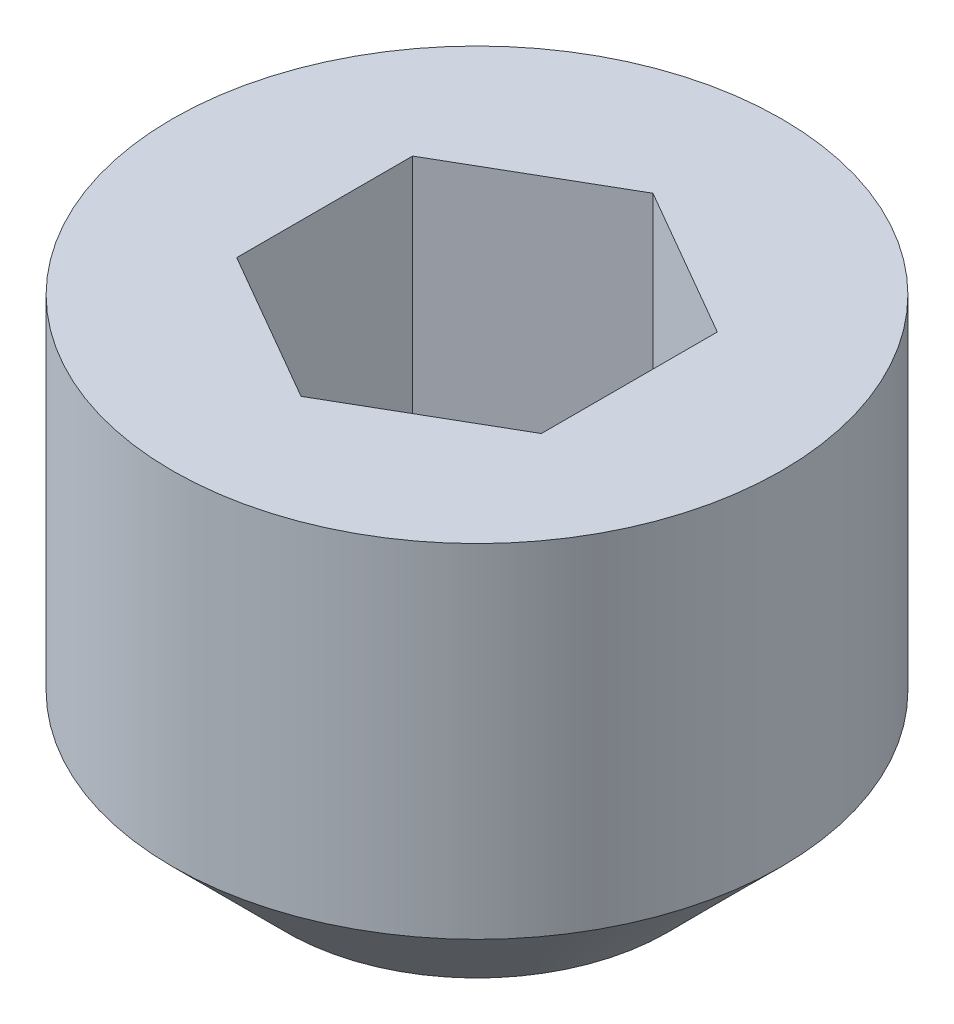
ISO-10303-21;
HEADER;
FILE_DESCRIPTION(('STEP AP214'),'2;1');
FILE_NAME('part.step','',(''),(''),'','','');
FILE_SCHEMA(('AUTOMOTIVE_DESIGN { 1 0 10303 214 1 1 1 1 }'));
ENDSEC;
DATA;
#1=APPLICATION_CONTEXT('core data for automotive mechanical design processes');
#2=APPLICATION_PROTOCOL_DEFINITION('international standard','automotive_design',2000,#1);
#3=PRODUCT_CONTEXT('',#1,'mechanical');
#4=PRODUCT('Part','Part','',(#3));
#5=PRODUCT_RELATED_PRODUCT_CATEGORY('part','',(#4));
#6=PRODUCT_DEFINITION_FORMATION('','',#4);
#7=PRODUCT_DEFINITION_CONTEXT('part definition',#1,'design');
#8=PRODUCT_DEFINITION('design','',#6,#7);
#9=PRODUCT_DEFINITION_SHAPE('','',#8);
#10=(LENGTH_UNIT() NAMED_UNIT(*) SI_UNIT(.MILLI.,.METRE.));
#11=(NAMED_UNIT(*) PLANE_ANGLE_UNIT() SI_UNIT($,.RADIAN.));
#12=(NAMED_UNIT(*) SI_UNIT($,.STERADIAN.) SOLID_ANGLE_UNIT());
#13=UNCERTAINTY_MEASURE_WITH_UNIT(LENGTH_MEASURE(1.E-05),#10,'distance_accuracy_value','');
#14=(GEOMETRIC_REPRESENTATION_CONTEXT(3) GLOBAL_UNCERTAINTY_ASSIGNED_CONTEXT((#13)) GLOBAL_UNIT_ASSIGNED_CONTEXT((#10,
#11,#12)) REPRESENTATION_CONTEXT('',''));
#15=CARTESIAN_POINT('',(0.,0.,0.));
#16=DIRECTION('',(0.,0.,1.));
#17=DIRECTION('',(1.,0.,0.));
#18=AXIS2_PLACEMENT_3D('',#15,#16,#17);
#19=CARTESIAN_POINT('',(0.,3.,0.));
#20=DIRECTION('',(0.,1.,0.));
#21=DIRECTION('',(-1.,0.,0.));
#22=AXIS2_PLACEMENT_3D('',#19,#20,#21);
#23=CYLINDRICAL_SURFACE('',#22,2.);
#24=CARTESIAN_POINT('',(0.,3.,0.));
#25=DIRECTION('',(0.,1.,0.));
#26=DIRECTION('',(-1.,0.,0.));
#27=AXIS2_PLACEMENT_3D('',#24,#25,#26);
#28=CIRCLE('',#27,2.);
#29=CARTESIAN_POINT('',(-2.,3.,0.));
#30=VERTEX_POINT('',#29);
#31=EDGE_CURVE('E11',#30,#30,#28,.T.);
#32=ORIENTED_EDGE('',*,*,#31,.F.);
#33=EDGE_LOOP('',(#32));
#34=FACE_BOUND('',#33,.T.);
#35=CARTESIAN_POINT('',(0.,0.749999999999992,0.));
#36=DIRECTION('',(0.,1.,0.));
#37=DIRECTION('',(-1.,0.,0.));
#38=AXIS2_PLACEMENT_3D('',#35,#36,#37);
#39=CIRCLE('',#38,2.);
#40=CARTESIAN_POINT('',(-2.,0.749999999999993,0.));
#41=VERTEX_POINT('',#40);
#42=EDGE_CURVE('E152',#41,#41,#39,.T.);
#43=ORIENTED_EDGE('',*,*,#42,.T.);
#44=EDGE_LOOP('',(#43));
#45=FACE_BOUND('',#44,.T.);
#46=ADVANCED_FACE('F36',(#34,#45),#23,.T.);
#47=CARTESIAN_POINT('',(0.,3.,0.));
#48=DIRECTION('',(0.,-1.,0.));
#49=DIRECTION('',(1.,0.,0.));
#50=AXIS2_PLACEMENT_3D('',#47,#48,#49);
#51=PLANE('',#50);
#52=ORIENTED_EDGE('',*,*,#31,.T.);
#53=EDGE_LOOP('',(#52));
#54=FACE_BOUND('',#53,.T.);
#55=DIRECTION('',(-0.866025403784438,0.,0.5));
#56=VECTOR('',#55,1.);
#57=CARTESIAN_POINT('',(0.,3.,-1.15470053837925));
#58=LINE('',#57,#56);
#59=CARTESIAN_POINT('',(0.,3.,-1.15470053837925));
#60=VERTEX_POINT('',#59);
#61=CARTESIAN_POINT('',(-1.,3.,-0.577350269189626));
#62=VERTEX_POINT('',#61);
#63=EDGE_CURVE('E151',#60,#62,#58,.T.);
#64=ORIENTED_EDGE('',*,*,#63,.F.);
#65=DIRECTION('',(-0.866025403784439,0.,-0.5));
#66=VECTOR('',#65,1.);
#67=CARTESIAN_POINT('',(1.,3.,-0.577350269189626));
#68=LINE('',#67,#66);
#69=CARTESIAN_POINT('',(1.,3.,-0.577350269189626));
#70=VERTEX_POINT('',#69);
#71=EDGE_CURVE('E51',#70,#60,#68,.T.);
#72=ORIENTED_EDGE('',*,*,#71,.F.);
#73=DIRECTION('',(0.,0.,-1.));
#74=VECTOR('',#73,1.);
#75=CARTESIAN_POINT('',(1.,3.,0.577350269189626));
#76=LINE('',#75,#74);
#77=CARTESIAN_POINT('',(1.,3.,0.577350269189626));
#78=VERTEX_POINT('',#77);
#79=EDGE_CURVE('E121',#78,#70,#76,.T.);
#80=ORIENTED_EDGE('',*,*,#79,.F.);
#81=DIRECTION('',(0.866025403784439,0.,-0.5));
#82=VECTOR('',#81,1.);
#83=CARTESIAN_POINT('',(0.,3.,1.15470053837925));
#84=LINE('',#83,#82);
#85=CARTESIAN_POINT('',(0.,3.,1.15470053837925));
#86=VERTEX_POINT('',#85);
#87=EDGE_CURVE('E159',#86,#78,#84,.T.);
#88=ORIENTED_EDGE('',*,*,#87,.F.);
#89=DIRECTION('',(0.866025403784439,0.,0.5));
#90=VECTOR('',#89,1.);
#91=CARTESIAN_POINT('',(-1.,3.,0.577350269189626));
#92=LINE('',#91,#90);
#93=CARTESIAN_POINT('',(-1.,3.,0.577350269189626));
#94=VERTEX_POINT('',#93);
#95=EDGE_CURVE('E156',#94,#86,#92,.T.);
#96=ORIENTED_EDGE('',*,*,#95,.F.);
#97=DIRECTION('',(0.,0.,1.));
#98=VECTOR('',#97,1.);
#99=CARTESIAN_POINT('',(-1.,3.,-0.577350269189626));
#100=LINE('',#99,#98);
#101=EDGE_CURVE('E154',#62,#94,#100,.T.);
#102=ORIENTED_EDGE('',*,*,#101,.F.);
#103=EDGE_LOOP('',(#64,#72,#80,#88,#96,#102));
#104=FACE_BOUND('',#103,.T.);
#105=ADVANCED_FACE('F201',(#54,#104),#51,.F.);
#106=CARTESIAN_POINT('',(1.,1.5,-0.577350269189626));
#107=DIRECTION('',(0.5,0.,-0.866025403784439));
#108=DIRECTION('',(-0.866025403784439,0.,-0.5));
#109=AXIS2_PLACEMENT_3D('',#106,#107,#108);
#110=PLANE('',#109);
#111=DIRECTION('',(-0.866025403784439,0.,-0.5));
#112=VECTOR('',#111,1.);
#113=CARTESIAN_POINT('',(1.,1.5,-0.577350269189626));
#114=LINE('',#113,#112);
#115=CARTESIAN_POINT('',(1.,1.5,-0.577350269189626));
#116=VERTEX_POINT('',#115);
#117=CARTESIAN_POINT('',(0.5,1.5,-0.866025403784439));
#118=VERTEX_POINT('',#117);
#119=EDGE_CURVE('E120',#116,#118,#114,.T.);
#120=ORIENTED_EDGE('',*,*,#119,.F.);
#121=DIRECTION('',(0.,1.,0.));
#122=VECTOR('',#121,1.);
#123=CARTESIAN_POINT('',(1.,1.5,-0.577350269189626));
#124=LINE('',#123,#122);
#125=EDGE_CURVE('E162',#116,#70,#124,.T.);
#126=ORIENTED_EDGE('',*,*,#125,.T.);
#127=ORIENTED_EDGE('',*,*,#71,.T.);
#128=DIRECTION('',(0.,1.,0.));
#129=VECTOR('',#128,1.);
#130=CARTESIAN_POINT('',(0.,1.5,-1.15470053837925));
#131=LINE('',#130,#129);
#132=CARTESIAN_POINT('',(0.,1.5,-1.15470053837925));
#133=VERTEX_POINT('',#132);
#134=EDGE_CURVE('E123',#133,#60,#131,.T.);
#135=ORIENTED_EDGE('',*,*,#134,.F.);
#136=EDGE_CURVE('E112',#118,#133,#114,.T.);
#137=ORIENTED_EDGE('',*,*,#136,.F.);
#138=EDGE_LOOP('',(#120,#126,#127,#135,#137));
#139=FACE_BOUND('',#138,.T.);
#140=ADVANCED_FACE('F124',(#139),#110,.F.);
#141=CARTESIAN_POINT('',(1.,1.5,0.577350269189626));
#142=DIRECTION('',(1.,0.,0.));
#143=DIRECTION('',(0.,0.,-1.));
#144=AXIS2_PLACEMENT_3D('',#141,#142,#143);
#145=PLANE('',#144);
#146=DIRECTION('',(0.,0.,-1.));
#147=VECTOR('',#146,1.);
#148=CARTESIAN_POINT('',(1.,1.5,0.577350269189626));
#149=LINE('',#148,#147);
#150=CARTESIAN_POINT('',(1.,1.5,0.577350269189626));
#151=VERTEX_POINT('',#150);
#152=CARTESIAN_POINT('',(1.,1.5,0.));
#153=VERTEX_POINT('',#152);
#154=EDGE_CURVE('E128',#151,#153,#149,.T.);
#155=ORIENTED_EDGE('',*,*,#154,.F.);
#156=DIRECTION('',(0.,1.,0.));
#157=VECTOR('',#156,1.);
#158=CARTESIAN_POINT('',(1.,1.5,0.577350269189626));
#159=LINE('',#158,#157);
#160=EDGE_CURVE('E165',#151,#78,#159,.T.);
#161=ORIENTED_EDGE('',*,*,#160,.T.);
#162=ORIENTED_EDGE('',*,*,#79,.T.);
#163=ORIENTED_EDGE('',*,*,#125,.F.);
#164=EDGE_CURVE('E147',#153,#116,#149,.T.);
#165=ORIENTED_EDGE('',*,*,#164,.F.);
#166=EDGE_LOOP('',(#155,#161,#162,#163,#165));
#167=FACE_BOUND('',#166,.T.);
#168=ADVANCED_FACE('F193',(#167),#145,.F.);
#169=CARTESIAN_POINT('',(0.,1.5,1.15470053837925));
#170=DIRECTION('',(0.5,0.,0.866025403784439));
#171=DIRECTION('',(0.866025403784439,0.,-0.5));
#172=AXIS2_PLACEMENT_3D('',#169,#170,#171);
#173=PLANE('',#172);
#174=DIRECTION('',(0.866025403784439,0.,-0.5));
#175=VECTOR('',#174,1.);
#176=CARTESIAN_POINT('',(0.,1.5,1.15470053837925));
#177=LINE('',#176,#175);
#178=CARTESIAN_POINT('',(0.,1.5,1.15470053837925));
#179=VERTEX_POINT('',#178);
#180=CARTESIAN_POINT('',(0.5,1.5,0.866025403784439));
#181=VERTEX_POINT('',#180);
#182=EDGE_CURVE('E59',#179,#181,#177,.T.);
#183=ORIENTED_EDGE('',*,*,#182,.F.);
#184=DIRECTION('',(0.,1.,0.));
#185=VECTOR('',#184,1.);
#186=CARTESIAN_POINT('',(0.,1.5,1.15470053837925));
#187=LINE('',#186,#185);
#188=EDGE_CURVE('E168',#179,#86,#187,.T.);
#189=ORIENTED_EDGE('',*,*,#188,.T.);
#190=ORIENTED_EDGE('',*,*,#87,.T.);
#191=ORIENTED_EDGE('',*,*,#160,.F.);
#192=EDGE_CURVE('E145',#181,#151,#177,.T.);
#193=ORIENTED_EDGE('',*,*,#192,.F.);
#194=EDGE_LOOP('',(#183,#189,#190,#191,#193));
#195=FACE_BOUND('',#194,.T.);
#196=ADVANCED_FACE('F198',(#195),#173,.F.);
#197=CARTESIAN_POINT('',(-1.,1.5,0.577350269189626));
#198=DIRECTION('',(-0.5,0.,0.866025403784439));
#199=DIRECTION('',(0.866025403784439,0.,0.5));
#200=AXIS2_PLACEMENT_3D('',#197,#198,#199);
#201=PLANE('',#200);
#202=DIRECTION('',(0.866025403784439,0.,0.5));
#203=VECTOR('',#202,1.);
#204=CARTESIAN_POINT('',(-1.,1.5,0.577350269189626));
#205=LINE('',#204,#203);
#206=CARTESIAN_POINT('',(-1.,1.5,0.577350269189626));
#207=VERTEX_POINT('',#206);
#208=CARTESIAN_POINT('',(-0.5,1.5,0.866025403784439));
#209=VERTEX_POINT('',#208);
#210=EDGE_CURVE('E142',#207,#209,#205,.T.);
#211=ORIENTED_EDGE('',*,*,#210,.F.);
#212=DIRECTION('',(0.,1.,0.));
#213=VECTOR('',#212,1.);
#214=CARTESIAN_POINT('',(-1.,1.5,0.577350269189626));
#215=LINE('',#214,#213);
#216=EDGE_CURVE('E171',#207,#94,#215,.T.);
#217=ORIENTED_EDGE('',*,*,#216,.T.);
#218=ORIENTED_EDGE('',*,*,#95,.T.);
#219=ORIENTED_EDGE('',*,*,#188,.F.);
#220=EDGE_CURVE('E141',#209,#179,#205,.T.);
#221=ORIENTED_EDGE('',*,*,#220,.F.);
#222=EDGE_LOOP('',(#211,#217,#218,#219,#221));
#223=FACE_BOUND('',#222,.T.);
#224=ADVANCED_FACE('F241',(#223),#201,.F.);
#225=CARTESIAN_POINT('',(-1.,1.5,-0.577350269189626));
#226=DIRECTION('',(-1.,0.,0.));
#227=DIRECTION('',(0.,-1.,0.));
#228=AXIS2_PLACEMENT_3D('',#225,#226,#227);
#229=PLANE('',#228);
#230=DIRECTION('',(0.,0.,1.));
#231=VECTOR('',#230,1.);
#232=CARTESIAN_POINT('',(-1.,1.5,-0.577350269189626));
#233=LINE('',#232,#231);
#234=CARTESIAN_POINT('',(-1.,1.5,-0.577350269189626));
#235=VERTEX_POINT('',#234);
#236=CARTESIAN_POINT('',(-1.,1.5,0.));
#237=VERTEX_POINT('',#236);
#238=EDGE_CURVE('E136',#235,#237,#233,.T.);
#239=ORIENTED_EDGE('',*,*,#238,.F.);
#240=DIRECTION('',(0.,1.,0.));
#241=VECTOR('',#240,1.);
#242=CARTESIAN_POINT('',(-1.,1.5,-0.577350269189626));
#243=LINE('',#242,#241);
#244=EDGE_CURVE('E127',#235,#62,#243,.T.);
#245=ORIENTED_EDGE('',*,*,#244,.T.);
#246=ORIENTED_EDGE('',*,*,#101,.T.);
#247=ORIENTED_EDGE('',*,*,#216,.F.);
#248=EDGE_CURVE('E134',#237,#207,#233,.T.);
#249=ORIENTED_EDGE('',*,*,#248,.F.);
#250=EDGE_LOOP('',(#239,#245,#246,#247,#249));
#251=FACE_BOUND('',#250,.T.);
#252=ADVANCED_FACE('F206',(#251),#229,.F.);
#253=CARTESIAN_POINT('',(0.,1.5,-1.15470053837925));
#254=DIRECTION('',(-0.5,0.,-0.866025403784438));
#255=DIRECTION('',(-0.866025403784439,0.,0.5));
#256=AXIS2_PLACEMENT_3D('',#253,#254,#255);
#257=PLANE('',#256);
#258=DIRECTION('',(-0.866025403784438,0.,0.5));
#259=VECTOR('',#258,1.);
#260=CARTESIAN_POINT('',(0.,1.5,-1.15470053837925));
#261=LINE('',#260,#259);
#262=CARTESIAN_POINT('',(-0.5,1.5,-0.866025403784438));
#263=VERTEX_POINT('',#262);
#264=EDGE_CURVE('E115',#133,#263,#261,.T.);
#265=ORIENTED_EDGE('',*,*,#264,.F.);
#266=ORIENTED_EDGE('',*,*,#134,.T.);
#267=ORIENTED_EDGE('',*,*,#63,.T.);
#268=ORIENTED_EDGE('',*,*,#244,.F.);
#269=EDGE_CURVE('E133',#263,#235,#261,.T.);
#270=ORIENTED_EDGE('',*,*,#269,.F.);
#271=EDGE_LOOP('',(#265,#266,#267,#268,#270));
#272=FACE_BOUND('',#271,.T.);
#273=ADVANCED_FACE('F131',(#272),#257,.F.);
#274=CARTESIAN_POINT('',(0.,1.5,0.));
#275=DIRECTION('',(0.,1.,0.));
#276=DIRECTION('',(0.,0.,1.));
#277=AXIS2_PLACEMENT_3D('',#274,#275,#276);
#278=PLANE('',#277);
#279=ORIENTED_EDGE('',*,*,#192,.T.);
#280=ORIENTED_EDGE('',*,*,#154,.T.);
#281=CARTESIAN_POINT('',(0.,1.5,0.));
#282=DIRECTION('',(0.,1.,0.));
#283=DIRECTION('',(0.,0.,1.));
#284=AXIS2_PLACEMENT_3D('',#281,#282,#283);
#285=CIRCLE('',#284,1.);
#286=EDGE_CURVE('E44',#181,#153,#285,.T.);
#287=ORIENTED_EDGE('',*,*,#286,.F.);
#288=EDGE_LOOP('',(#279,#280,#287));
#289=FACE_BOUND('',#288,.T.);
#290=ADVANCED_FACE('F195',(#289),#278,.T.);
#291=ORIENTED_EDGE('',*,*,#164,.T.);
#292=ORIENTED_EDGE('',*,*,#119,.T.);
#293=EDGE_CURVE('E176',#153,#118,#285,.T.);
#294=ORIENTED_EDGE('',*,*,#293,.F.);
#295=EDGE_LOOP('',(#291,#292,#294));
#296=FACE_BOUND('',#295,.T.);
#297=ADVANCED_FACE('F189',(#296),#278,.T.);
#298=ORIENTED_EDGE('',*,*,#136,.T.);
#299=ORIENTED_EDGE('',*,*,#264,.T.);
#300=EDGE_CURVE('E117',#118,#263,#285,.T.);
#301=ORIENTED_EDGE('',*,*,#300,.F.);
#302=EDGE_LOOP('',(#298,#299,#301));
#303=FACE_BOUND('',#302,.T.);
#304=ADVANCED_FACE('F113',(#303),#278,.T.);
#305=ORIENTED_EDGE('',*,*,#269,.T.);
#306=ORIENTED_EDGE('',*,*,#238,.T.);
#307=EDGE_CURVE('E183',#263,#237,#285,.T.);
#308=ORIENTED_EDGE('',*,*,#307,.F.);
#309=EDGE_LOOP('',(#305,#306,#308));
#310=FACE_BOUND('',#309,.T.);
#311=ADVANCED_FACE('F210',(#310),#278,.T.);
#312=ORIENTED_EDGE('',*,*,#248,.T.);
#313=ORIENTED_EDGE('',*,*,#210,.T.);
#314=EDGE_CURVE('E181',#237,#209,#285,.T.);
#315=ORIENTED_EDGE('',*,*,#314,.F.);
#316=EDGE_LOOP('',(#312,#313,#315));
#317=FACE_BOUND('',#316,.T.);
#318=ADVANCED_FACE('F212',(#317),#278,.T.);
#319=ORIENTED_EDGE('',*,*,#220,.T.);
#320=ORIENTED_EDGE('',*,*,#182,.T.);
#321=EDGE_CURVE('E164',#209,#181,#285,.T.);
#322=ORIENTED_EDGE('',*,*,#321,.F.);
#323=EDGE_LOOP('',(#319,#320,#322));
#324=FACE_BOUND('',#323,.T.);
#325=ADVANCED_FACE('F218',(#324),#278,.T.);
#326=CARTESIAN_POINT('',(0.,0.922649730810367,0.));
#327=DIRECTION('',(0.,1.,0.));
#328=DIRECTION('',(0.,0.,1.));
#329=AXIS2_PLACEMENT_3D('',#326,#327,#328);
#330=CONICAL_SURFACE('',#329,0.,1.04719755119659);
#331=ORIENTED_EDGE('',*,*,#286,.T.);
#332=ORIENTED_EDGE('',*,*,#293,.T.);
#333=ORIENTED_EDGE('',*,*,#300,.T.);
#334=ORIENTED_EDGE('',*,*,#307,.T.);
#335=ORIENTED_EDGE('',*,*,#314,.T.);
#336=ORIENTED_EDGE('',*,*,#321,.T.);
#337=EDGE_LOOP('',(#331,#332,#333,#334,#335,#336));
#338=FACE_BOUND('',#337,.T.);
#339=CARTESIAN_POINT('',(0.,0.922649730810367,0.));
#340=VERTEX_POINT('',#339);
#341=VERTEX_LOOP('',#340);
#342=FACE_BOUND('',#341,.T.);
#343=ADVANCED_FACE('F185',(#338,#342),#330,.F.);
#344=CARTESIAN_POINT('',(0.,0.749999999999992,0.));
#345=DIRECTION('',(0.,1.,0.));
#346=DIRECTION('',(-1.,0.,0.));
#347=AXIS2_PLACEMENT_3D('',#344,#345,#346);
#348=CONICAL_SURFACE('',#347,2.,0.785398163397454);
#349=CARTESIAN_POINT('',(0.,0.,0.));
#350=DIRECTION('',(0.,1.,0.));
#351=DIRECTION('',(-1.,0.,0.));
#352=AXIS2_PLACEMENT_3D('',#349,#350,#351);
#353=CIRCLE('',#352,1.25);
#354=CARTESIAN_POINT('',(-1.25,0.,0.));
#355=VERTEX_POINT('',#354);
#356=EDGE_CURVE('E334',#355,#355,#353,.T.);
#357=ORIENTED_EDGE('',*,*,#356,.T.);
#358=EDGE_LOOP('',(#357));
#359=FACE_BOUND('',#358,.T.);
#360=ORIENTED_EDGE('',*,*,#42,.F.);
#361=EDGE_LOOP('',(#360));
#362=FACE_BOUND('',#361,.T.);
#363=ADVANCED_FACE('F234',(#359,#362),#348,.T.);
#364=CARTESIAN_POINT('',(0.,0.,0.));
#365=DIRECTION('',(0.,1.,0.));
#366=DIRECTION('',(-1.,0.,0.));
#367=AXIS2_PLACEMENT_3D('',#364,#365,#366);
#368=PLANE('',#367);
#369=ORIENTED_EDGE('',*,*,#356,.F.);
#370=EDGE_LOOP('',(#369));
#371=FACE_BOUND('',#370,.T.);
#372=ADVANCED_FACE('F38',(#371),#368,.F.);
#373=CLOSED_SHELL('',(#46,#105,#140,#168,#196,#224,#252,#273,#290,#297,#304,#311,#318,#325,#343,
#363,#372));
#374=MANIFOLD_SOLID_BREP('B2',#373);
#375=ADVANCED_BREP_SHAPE_REPRESENTATION('',(#18,#374),#14);
#376=SHAPE_DEFINITION_REPRESENTATION(#9,#375);
ENDSEC;
END-ISO-10303-21;
